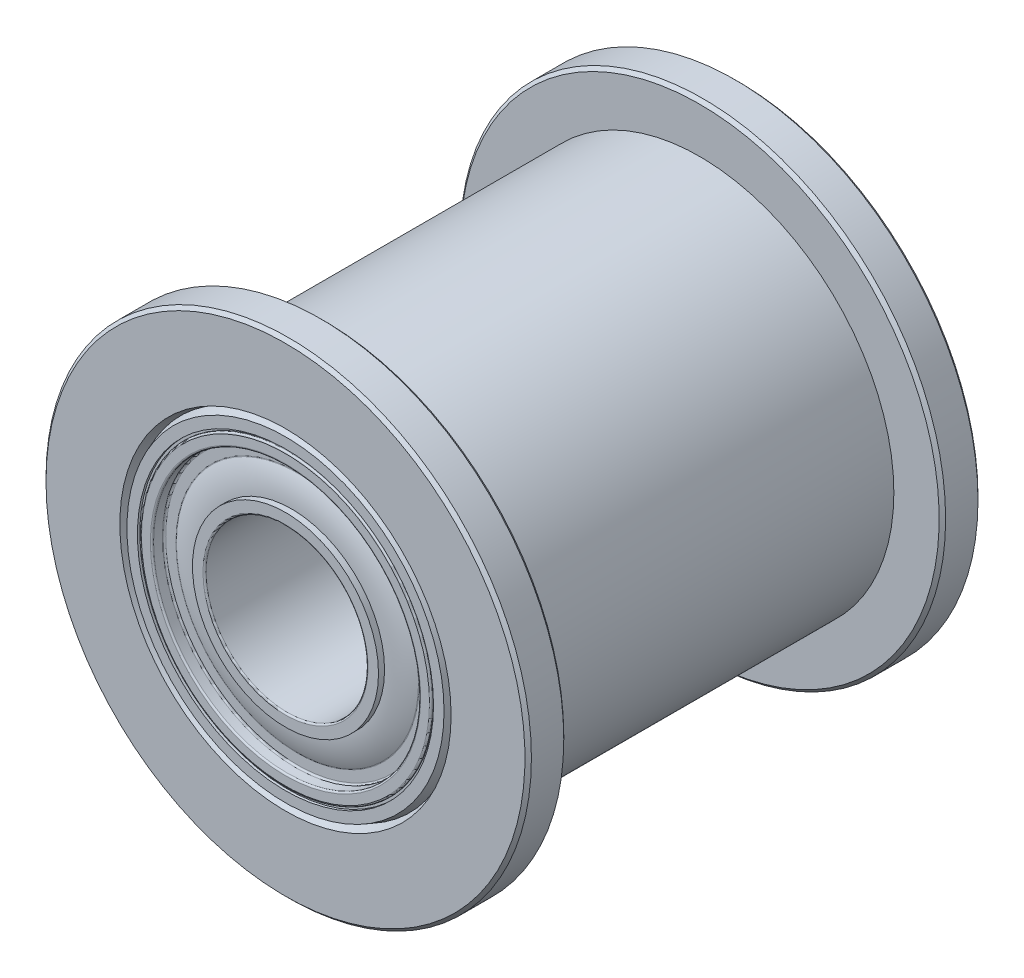
ISO-10303-21;
HEADER;
FILE_DESCRIPTION(('STEP AP214'),'2;1');
FILE_NAME('part.step','',(''),(''),'','','');
FILE_SCHEMA(('AUTOMOTIVE_DESIGN { 1 0 10303 214 1 1 1 1 }'));
ENDSEC;
DATA;
#1=APPLICATION_CONTEXT('core data for automotive mechanical design processes');
#2=APPLICATION_PROTOCOL_DEFINITION('international standard','automotive_design',2000,#1);
#3=PRODUCT_CONTEXT('',#1,'mechanical');
#4=PRODUCT('Part','Part','',(#3));
#5=PRODUCT_RELATED_PRODUCT_CATEGORY('part','',(#4));
#6=PRODUCT_DEFINITION_FORMATION('','',#4);
#7=PRODUCT_DEFINITION_CONTEXT('part definition',#1,'design');
#8=PRODUCT_DEFINITION('design','',#6,#7);
#9=PRODUCT_DEFINITION_SHAPE('','',#8);
#10=(LENGTH_UNIT() NAMED_UNIT(*) SI_UNIT(.MILLI.,.METRE.));
#11=(NAMED_UNIT(*) PLANE_ANGLE_UNIT() SI_UNIT($,.RADIAN.));
#12=(NAMED_UNIT(*) SI_UNIT($,.STERADIAN.) SOLID_ANGLE_UNIT());
#13=UNCERTAINTY_MEASURE_WITH_UNIT(LENGTH_MEASURE(1.E-05),#10,'distance_accuracy_value','');
#14=(GEOMETRIC_REPRESENTATION_CONTEXT(3) GLOBAL_UNCERTAINTY_ASSIGNED_CONTEXT((#13)) GLOBAL_UNIT_ASSIGNED_CONTEXT((#10,
#11,#12)) REPRESENTATION_CONTEXT('',''));
#15=CARTESIAN_POINT('',(0.,0.,0.));
#16=DIRECTION('',(0.,0.,1.));
#17=DIRECTION('',(1.,0.,0.));
#18=AXIS2_PLACEMENT_3D('',#15,#16,#17);
#19=CARTESIAN_POINT('',(0.,7.5,-5.8));
#20=DIRECTION('',(0.,0.,-1.));
#21=DIRECTION('',(-1.,0.,0.));
#22=AXIS2_PLACEMENT_3D('',#19,#20,#21);
#23=PLANE('',#22);
#24=CARTESIAN_POINT('',(0.,0.,-5.8));
#25=DIRECTION('',(0.,0.,-1.));
#26=DIRECTION('',(-1.,0.,0.));
#27=AXIS2_PLACEMENT_3D('',#24,#25,#26);
#28=CIRCLE('',#27,7.40000000000001);
#29=CARTESIAN_POINT('',(-7.40000000000001,0.,-5.8));
#30=VERTEX_POINT('',#29);
#31=EDGE_CURVE('E54',#30,#30,#28,.F.);
#32=ORIENTED_EDGE('',*,*,#31,.T.);
#33=EDGE_LOOP('',(#32));
#34=FACE_BOUND('',#33,.T.);
#35=CARTESIAN_POINT('',(0.,0.,-5.8));
#36=DIRECTION('',(0.,0.,1.));
#37=DIRECTION('',(1.,0.,0.));
#38=AXIS2_PLACEMENT_3D('',#35,#36,#37);
#39=CIRCLE('',#38,6.);
#40=CARTESIAN_POINT('',(6.,0.,-5.8));
#41=VERTEX_POINT('',#40);
#42=EDGE_CURVE('E85',#41,#41,#39,.T.);
#43=ORIENTED_EDGE('',*,*,#42,.F.);
#44=EDGE_LOOP('',(#43));
#45=FACE_BOUND('',#44,.T.);
#46=ADVANCED_FACE('F34',(#34,#45),#23,.F.);
#47=CARTESIAN_POINT('',(0.,0.,7.));
#48=DIRECTION('',(0.,0.,1.));
#49=DIRECTION('',(1.,0.,0.));
#50=AXIS2_PLACEMENT_3D('',#47,#48,#49);
#51=CYLINDRICAL_SURFACE('',#50,7.5);
#52=CARTESIAN_POINT('',(0.,0.,-6.9));
#53=DIRECTION('',(0.,0.,1.));
#54=DIRECTION('',(1.,0.,0.));
#55=AXIS2_PLACEMENT_3D('',#52,#53,#54);
#56=CIRCLE('',#55,7.5);
#57=CARTESIAN_POINT('',(7.5,0.,-6.9));
#58=VERTEX_POINT('',#57);
#59=EDGE_CURVE('E60',#58,#58,#56,.T.);
#60=ORIENTED_EDGE('',*,*,#59,.T.);
#61=EDGE_LOOP('',(#60));
#62=FACE_BOUND('',#61,.T.);
#63=CARTESIAN_POINT('',(0.,0.,-5.9));
#64=DIRECTION('',(0.,0.,-1.));
#65=DIRECTION('',(-1.,0.,0.));
#66=AXIS2_PLACEMENT_3D('',#63,#64,#65);
#67=CIRCLE('',#66,7.5);
#68=CARTESIAN_POINT('',(-7.5,0.,-5.9));
#69=VERTEX_POINT('',#68);
#70=EDGE_CURVE('E63',#69,#69,#67,.T.);
#71=ORIENTED_EDGE('',*,*,#70,.T.);
#72=EDGE_LOOP('',(#71));
#73=FACE_BOUND('',#72,.T.);
#74=ADVANCED_FACE('F200',(#62,#73),#51,.T.);
#75=CARTESIAN_POINT('',(0.,7.5,-7.));
#76=DIRECTION('',(0.,0.,1.));
#77=DIRECTION('',(1.,0.,0.));
#78=AXIS2_PLACEMENT_3D('',#75,#76,#77);
#79=PLANE('',#78);
#80=CARTESIAN_POINT('',(0.,0.,-7.));
#81=DIRECTION('',(0.,0.,1.));
#82=DIRECTION('',(1.,0.,0.));
#83=AXIS2_PLACEMENT_3D('',#80,#81,#82);
#84=CIRCLE('',#83,7.4);
#85=CARTESIAN_POINT('',(7.4,0.,-7.));
#86=VERTEX_POINT('',#85);
#87=EDGE_CURVE('E57',#86,#86,#84,.F.);
#88=ORIENTED_EDGE('',*,*,#87,.T.);
#89=EDGE_LOOP('',(#88));
#90=FACE_BOUND('',#89,.T.);
#91=CARTESIAN_POINT('',(0.,0.,-7.));
#92=DIRECTION('',(0.,0.,1.));
#93=DIRECTION('',(1.,0.,0.));
#94=AXIS2_PLACEMENT_3D('',#91,#92,#93);
#95=CIRCLE('',#94,5.11838214055972);
#96=CARTESIAN_POINT('',(5.11838214055972,0.,-7.));
#97=VERTEX_POINT('',#96);
#98=EDGE_CURVE('E66',#97,#97,#95,.T.);
#99=ORIENTED_EDGE('',*,*,#98,.T.);
#100=EDGE_LOOP('',(#99));
#101=FACE_BOUND('',#100,.T.);
#102=ADVANCED_FACE('F206',(#90,#101),#79,.F.);
#103=CARTESIAN_POINT('',(0.,0.,-6.7));
#104=DIRECTION('',(0.,0.,-1.));
#105=DIRECTION('',(-1.,0.,0.));
#106=AXIS2_PLACEMENT_3D('',#103,#104,#105);
#107=CONICAL_SURFACE('',#106,5.00919107027986,0.349065850398864);
#108=ORIENTED_EDGE('',*,*,#98,.F.);
#109=EDGE_LOOP('',(#108));
#110=FACE_BOUND('',#109,.T.);
#111=CARTESIAN_POINT('',(0.,0.,-6.7));
#112=DIRECTION('',(0.,0.,1.));
#113=DIRECTION('',(1.,0.,0.));
#114=AXIS2_PLACEMENT_3D('',#111,#112,#113);
#115=CIRCLE('',#114,5.00919107027986);
#116=CARTESIAN_POINT('',(5.00919107027986,0.,-6.7));
#117=VERTEX_POINT('',#116);
#118=EDGE_CURVE('E69',#117,#117,#115,.T.);
#119=ORIENTED_EDGE('',*,*,#118,.T.);
#120=EDGE_LOOP('',(#119));
#121=FACE_BOUND('',#120,.T.);
#122=ADVANCED_FACE('F282',(#110,#121),#107,.F.);
#123=CARTESIAN_POINT('',(0.,0.,-7.));
#124=DIRECTION('',(0.,0.,1.));
#125=DIRECTION('',(1.,0.,0.));
#126=AXIS2_PLACEMENT_3D('',#123,#124,#125);
#127=CONICAL_SURFACE('',#126,4.9,0.349065850398864);
#128=ORIENTED_EDGE('',*,*,#118,.F.);
#129=EDGE_LOOP('',(#128));
#130=FACE_BOUND('',#129,.T.);
#131=CARTESIAN_POINT('',(0.,0.,-7.));
#132=DIRECTION('',(0.,0.,1.));
#133=DIRECTION('',(1.,0.,0.));
#134=AXIS2_PLACEMENT_3D('',#131,#132,#133);
#135=CIRCLE('',#134,4.9);
#136=CARTESIAN_POINT('',(4.9,0.,-7.));
#137=VERTEX_POINT('',#136);
#138=EDGE_CURVE('E72',#137,#137,#135,.T.);
#139=ORIENTED_EDGE('',*,*,#138,.T.);
#140=EDGE_LOOP('',(#139));
#141=FACE_BOUND('',#140,.T.);
#142=ADVANCED_FACE('F278',(#130,#141),#127,.T.);
#143=CARTESIAN_POINT('',(0.,4.9,-7.));
#144=DIRECTION('',(0.,0.,1.));
#145=DIRECTION('',(1.,0.,0.));
#146=AXIS2_PLACEMENT_3D('',#143,#144,#145);
#147=PLANE('',#146);
#148=ORIENTED_EDGE('',*,*,#138,.F.);
#149=EDGE_LOOP('',(#148));
#150=FACE_BOUND('',#149,.T.);
#151=CARTESIAN_POINT('',(0.,0.,-7.));
#152=DIRECTION('',(0.,0.,1.));
#153=DIRECTION('',(1.,0.,0.));
#154=AXIS2_PLACEMENT_3D('',#151,#152,#153);
#155=CIRCLE('',#154,4.575);
#156=CARTESIAN_POINT('',(4.575,0.,-7.));
#157=VERTEX_POINT('',#156);
#158=EDGE_CURVE('E75',#157,#157,#155,.T.);
#159=ORIENTED_EDGE('',*,*,#158,.T.);
#160=EDGE_LOOP('',(#159));
#161=FACE_BOUND('',#160,.T.);
#162=ADVANCED_FACE('F274',(#150,#161),#147,.F.);
#163=CARTESIAN_POINT('',(0.,0.,7.));
#164=DIRECTION('',(0.,0.,1.));
#165=DIRECTION('',(1.,0.,0.));
#166=AXIS2_PLACEMENT_3D('',#163,#164,#165);
#167=CYLINDRICAL_SURFACE('',#166,4.575);
#168=ORIENTED_EDGE('',*,*,#158,.F.);
#169=EDGE_LOOP('',(#168));
#170=FACE_BOUND('',#169,.T.);
#171=CARTESIAN_POINT('',(0.,0.,-6.925));
#172=DIRECTION('',(0.,0.,1.));
#173=DIRECTION('',(1.,0.,0.));
#174=AXIS2_PLACEMENT_3D('',#171,#172,#173);
#175=CIRCLE('',#174,4.575);
#176=CARTESIAN_POINT('',(4.575,0.,-6.925));
#177=VERTEX_POINT('',#176);
#178=EDGE_CURVE('E78',#177,#177,#175,.T.);
#179=ORIENTED_EDGE('',*,*,#178,.T.);
#180=EDGE_LOOP('',(#179));
#181=FACE_BOUND('',#180,.T.);
#182=ADVANCED_FACE('F270',(#170,#181),#167,.F.);
#183=CARTESIAN_POINT('',(0.,4.5,-6.925));
#184=DIRECTION('',(0.,0.,1.));
#185=DIRECTION('',(1.,0.,0.));
#186=AXIS2_PLACEMENT_3D('',#183,#184,#185);
#187=PLANE('',#186);
#188=ORIENTED_EDGE('',*,*,#178,.F.);
#189=EDGE_LOOP('',(#188));
#190=FACE_BOUND('',#189,.T.);
#191=CARTESIAN_POINT('',(0.,0.,-6.925));
#192=DIRECTION('',(0.,0.,1.));
#193=DIRECTION('',(1.,0.,0.));
#194=AXIS2_PLACEMENT_3D('',#191,#192,#193);
#195=CIRCLE('',#194,4.5);
#196=CARTESIAN_POINT('',(4.5,0.,-6.925));
#197=VERTEX_POINT('',#196);
#198=EDGE_CURVE('E82',#197,#197,#195,.T.);
#199=ORIENTED_EDGE('',*,*,#198,.T.);
#200=EDGE_LOOP('',(#199));
#201=FACE_BOUND('',#200,.T.);
#202=ADVANCED_FACE('F266',(#190,#201),#187,.F.);
#203=CARTESIAN_POINT('',(0.,4.5,6.925));
#204=DIRECTION('',(0.,0.,-1.));
#205=DIRECTION('',(-1.,0.,0.));
#206=AXIS2_PLACEMENT_3D('',#203,#204,#205);
#207=PLANE('',#206);
#208=CARTESIAN_POINT('',(0.,0.,6.925));
#209=DIRECTION('',(0.,0.,1.));
#210=DIRECTION('',(1.,0.,0.));
#211=AXIS2_PLACEMENT_3D('',#208,#209,#210);
#212=CIRCLE('',#211,4.5);
#213=CARTESIAN_POINT('',(4.5,0.,6.925));
#214=VERTEX_POINT('',#213);
#215=EDGE_CURVE('E81',#214,#214,#212,.T.);
#216=ORIENTED_EDGE('',*,*,#215,.F.);
#217=EDGE_LOOP('',(#216));
#218=FACE_BOUND('',#217,.T.);
#219=CARTESIAN_POINT('',(0.,0.,6.925));
#220=DIRECTION('',(0.,0.,1.));
#221=DIRECTION('',(1.,0.,0.));
#222=AXIS2_PLACEMENT_3D('',#219,#220,#221);
#223=CIRCLE('',#222,4.575);
#224=CARTESIAN_POINT('',(4.575,0.,6.925));
#225=VERTEX_POINT('',#224);
#226=EDGE_CURVE('E89',#225,#225,#223,.T.);
#227=ORIENTED_EDGE('',*,*,#226,.T.);
#228=EDGE_LOOP('',(#227));
#229=FACE_BOUND('',#228,.T.);
#230=ADVANCED_FACE('F262',(#218,#229),#207,.F.);
#231=CARTESIAN_POINT('',(0.,0.,7.));
#232=DIRECTION('',(0.,0.,1.));
#233=DIRECTION('',(1.,0.,0.));
#234=AXIS2_PLACEMENT_3D('',#231,#232,#233);
#235=CYLINDRICAL_SURFACE('',#234,4.575);
#236=ORIENTED_EDGE('',*,*,#226,.F.);
#237=EDGE_LOOP('',(#236));
#238=FACE_BOUND('',#237,.T.);
#239=CARTESIAN_POINT('',(0.,0.,7.));
#240=DIRECTION('',(0.,0.,1.));
#241=DIRECTION('',(1.,0.,0.));
#242=AXIS2_PLACEMENT_3D('',#239,#240,#241);
#243=CIRCLE('',#242,4.575);
#244=CARTESIAN_POINT('',(4.575,0.,7.));
#245=VERTEX_POINT('',#244);
#246=EDGE_CURVE('E92',#245,#245,#243,.T.);
#247=ORIENTED_EDGE('',*,*,#246,.T.);
#248=EDGE_LOOP('',(#247));
#249=FACE_BOUND('',#248,.T.);
#250=ADVANCED_FACE('F258',(#238,#249),#235,.F.);
#251=CARTESIAN_POINT('',(0.,4.9,7.));
#252=DIRECTION('',(0.,0.,-1.));
#253=DIRECTION('',(-1.,0.,0.));
#254=AXIS2_PLACEMENT_3D('',#251,#252,#253);
#255=PLANE('',#254);
#256=ORIENTED_EDGE('',*,*,#246,.F.);
#257=EDGE_LOOP('',(#256));
#258=FACE_BOUND('',#257,.T.);
#259=CARTESIAN_POINT('',(0.,0.,7.));
#260=DIRECTION('',(0.,0.,1.));
#261=DIRECTION('',(1.,0.,0.));
#262=AXIS2_PLACEMENT_3D('',#259,#260,#261);
#263=CIRCLE('',#262,4.9);
#264=CARTESIAN_POINT('',(4.9,0.,7.));
#265=VERTEX_POINT('',#264);
#266=EDGE_CURVE('E95',#265,#265,#263,.T.);
#267=ORIENTED_EDGE('',*,*,#266,.T.);
#268=EDGE_LOOP('',(#267));
#269=FACE_BOUND('',#268,.T.);
#270=ADVANCED_FACE('F254',(#258,#269),#255,.F.);
#271=CARTESIAN_POINT('',(0.,0.,6.7));
#272=DIRECTION('',(0.,0.,-1.));
#273=DIRECTION('',(-1.,0.,0.));
#274=AXIS2_PLACEMENT_3D('',#271,#272,#273);
#275=CONICAL_SURFACE('',#274,5.00919107027986,0.349065850398864);
#276=ORIENTED_EDGE('',*,*,#266,.F.);
#277=EDGE_LOOP('',(#276));
#278=FACE_BOUND('',#277,.T.);
#279=CARTESIAN_POINT('',(0.,0.,6.7));
#280=DIRECTION('',(0.,0.,1.));
#281=DIRECTION('',(1.,0.,0.));
#282=AXIS2_PLACEMENT_3D('',#279,#280,#281);
#283=CIRCLE('',#282,5.00919107027986);
#284=CARTESIAN_POINT('',(5.00919107027986,0.,6.7));
#285=VERTEX_POINT('',#284);
#286=EDGE_CURVE('E98',#285,#285,#283,.T.);
#287=ORIENTED_EDGE('',*,*,#286,.T.);
#288=EDGE_LOOP('',(#287));
#289=FACE_BOUND('',#288,.T.);
#290=ADVANCED_FACE('F250',(#278,#289),#275,.T.);
#291=CARTESIAN_POINT('',(0.,0.,7.));
#292=DIRECTION('',(0.,0.,1.));
#293=DIRECTION('',(1.,0.,0.));
#294=AXIS2_PLACEMENT_3D('',#291,#292,#293);
#295=CONICAL_SURFACE('',#294,5.11838214055972,0.349065850398864);
#296=ORIENTED_EDGE('',*,*,#286,.F.);
#297=EDGE_LOOP('',(#296));
#298=FACE_BOUND('',#297,.T.);
#299=CARTESIAN_POINT('',(0.,0.,7.));
#300=DIRECTION('',(0.,0.,1.));
#301=DIRECTION('',(1.,0.,0.));
#302=AXIS2_PLACEMENT_3D('',#299,#300,#301);
#303=CIRCLE('',#302,5.11838214055972);
#304=CARTESIAN_POINT('',(5.11838214055972,0.,7.));
#305=VERTEX_POINT('',#304);
#306=EDGE_CURVE('E101',#305,#305,#303,.T.);
#307=ORIENTED_EDGE('',*,*,#306,.T.);
#308=EDGE_LOOP('',(#307));
#309=FACE_BOUND('',#308,.T.);
#310=ADVANCED_FACE('F244',(#298,#309),#295,.F.);
#311=CARTESIAN_POINT('',(0.,7.5,7.));
#312=DIRECTION('',(0.,0.,-1.));
#313=DIRECTION('',(-1.,0.,0.));
#314=AXIS2_PLACEMENT_3D('',#311,#312,#313);
#315=PLANE('',#314);
#316=CARTESIAN_POINT('',(0.,0.,7.));
#317=DIRECTION('',(0.,0.,-1.));
#318=DIRECTION('',(-1.,0.,0.));
#319=AXIS2_PLACEMENT_3D('',#316,#317,#318);
#320=CIRCLE('',#319,7.4);
#321=CARTESIAN_POINT('',(-7.4,0.,7.));
#322=VERTEX_POINT('',#321);
#323=EDGE_CURVE('E10',#322,#322,#320,.F.);
#324=ORIENTED_EDGE('',*,*,#323,.T.);
#325=EDGE_LOOP('',(#324));
#326=FACE_BOUND('',#325,.T.);
#327=ORIENTED_EDGE('',*,*,#306,.F.);
#328=EDGE_LOOP('',(#327));
#329=FACE_BOUND('',#328,.T.);
#330=ADVANCED_FACE('F235',(#326,#329),#315,.F.);
#331=CARTESIAN_POINT('',(0.,0.,7.));
#332=DIRECTION('',(0.,0.,1.));
#333=DIRECTION('',(1.,0.,0.));
#334=AXIS2_PLACEMENT_3D('',#331,#332,#333);
#335=CYLINDRICAL_SURFACE('',#334,7.5);
#336=CARTESIAN_POINT('',(0.,0.,5.9));
#337=DIRECTION('',(0.,0.,1.));
#338=DIRECTION('',(1.,0.,0.));
#339=AXIS2_PLACEMENT_3D('',#336,#337,#338);
#340=CIRCLE('',#339,7.5);
#341=CARTESIAN_POINT('',(7.5,0.,5.9));
#342=VERTEX_POINT('',#341);
#343=EDGE_CURVE('E45',#342,#342,#340,.T.);
#344=ORIENTED_EDGE('',*,*,#343,.T.);
#345=EDGE_LOOP('',(#344));
#346=FACE_BOUND('',#345,.T.);
#347=CARTESIAN_POINT('',(0.,0.,6.9));
#348=DIRECTION('',(0.,0.,-1.));
#349=DIRECTION('',(-1.,0.,0.));
#350=AXIS2_PLACEMENT_3D('',#347,#348,#349);
#351=CIRCLE('',#350,7.5);
#352=CARTESIAN_POINT('',(-7.5,0.,6.9));
#353=VERTEX_POINT('',#352);
#354=EDGE_CURVE('E49',#353,#353,#351,.T.);
#355=ORIENTED_EDGE('',*,*,#354,.T.);
#356=EDGE_LOOP('',(#355));
#357=FACE_BOUND('',#356,.T.);
#358=ADVANCED_FACE('F231',(#346,#357),#335,.T.);
#359=CARTESIAN_POINT('',(0.,7.5,5.8));
#360=DIRECTION('',(0.,0.,1.));
#361=DIRECTION('',(1.,0.,0.));
#362=AXIS2_PLACEMENT_3D('',#359,#360,#361);
#363=PLANE('',#362);
#364=CARTESIAN_POINT('',(0.,0.,5.8));
#365=DIRECTION('',(0.,0.,1.));
#366=DIRECTION('',(1.,0.,0.));
#367=AXIS2_PLACEMENT_3D('',#364,#365,#366);
#368=CIRCLE('',#367,7.4);
#369=CARTESIAN_POINT('',(7.4,0.,5.8));
#370=VERTEX_POINT('',#369);
#371=EDGE_CURVE('E41',#370,#370,#368,.F.);
#372=ORIENTED_EDGE('',*,*,#371,.T.);
#373=EDGE_LOOP('',(#372));
#374=FACE_BOUND('',#373,.T.);
#375=CARTESIAN_POINT('',(0.,0.,5.8));
#376=DIRECTION('',(0.,0.,1.));
#377=DIRECTION('',(1.,0.,0.));
#378=AXIS2_PLACEMENT_3D('',#375,#376,#377);
#379=CIRCLE('',#378,6.);
#380=CARTESIAN_POINT('',(6.,0.,5.8));
#381=VERTEX_POINT('',#380);
#382=EDGE_CURVE('E104',#381,#381,#379,.T.);
#383=ORIENTED_EDGE('',*,*,#382,.T.);
#384=EDGE_LOOP('',(#383));
#385=FACE_BOUND('',#384,.T.);
#386=ADVANCED_FACE('F234',(#374,#385),#363,.F.);
#387=CARTESIAN_POINT('',(0.,0.,7.));
#388=DIRECTION('',(0.,0.,1.));
#389=DIRECTION('',(1.,0.,0.));
#390=AXIS2_PLACEMENT_3D('',#387,#388,#389);
#391=CYLINDRICAL_SURFACE('',#390,6.);
#392=ORIENTED_EDGE('',*,*,#382,.F.);
#393=EDGE_LOOP('',(#392));
#394=FACE_BOUND('',#393,.T.);
#395=ORIENTED_EDGE('',*,*,#42,.T.);
#396=EDGE_LOOP('',(#395));
#397=FACE_BOUND('',#396,.T.);
#398=ADVANCED_FACE('F216',(#394,#397),#391,.T.);
#399=CARTESIAN_POINT('',(0.,0.,-6.9));
#400=DIRECTION('',(0.,0.,1.));
#401=DIRECTION('',(1.,0.,0.));
#402=AXIS2_PLACEMENT_3D('',#399,#400,#401);
#403=CONICAL_SURFACE('',#402,7.5,0.78539816339744);
#404=ORIENTED_EDGE('',*,*,#87,.F.);
#405=EDGE_LOOP('',(#404));
#406=FACE_BOUND('',#405,.T.);
#407=ORIENTED_EDGE('',*,*,#59,.F.);
#408=EDGE_LOOP('',(#407));
#409=FACE_BOUND('',#408,.T.);
#410=ADVANCED_FACE('F212',(#406,#409),#403,.T.);
#411=CARTESIAN_POINT('',(0.,0.,-5.8));
#412=DIRECTION('',(0.,0.,-1.));
#413=DIRECTION('',(-1.,0.,0.));
#414=AXIS2_PLACEMENT_3D('',#411,#412,#413);
#415=CONICAL_SURFACE('',#414,7.40000000000001,0.785398163397457);
#416=ORIENTED_EDGE('',*,*,#70,.F.);
#417=EDGE_LOOP('',(#416));
#418=FACE_BOUND('',#417,.T.);
#419=ORIENTED_EDGE('',*,*,#31,.F.);
#420=EDGE_LOOP('',(#419));
#421=FACE_BOUND('',#420,.T.);
#422=ADVANCED_FACE('F215',(#418,#421),#415,.T.);
#423=CARTESIAN_POINT('',(0.,0.,5.9));
#424=DIRECTION('',(0.,0.,1.));
#425=DIRECTION('',(1.,0.,0.));
#426=AXIS2_PLACEMENT_3D('',#423,#424,#425);
#427=CONICAL_SURFACE('',#426,7.5,0.785398163397444);
#428=ORIENTED_EDGE('',*,*,#371,.F.);
#429=EDGE_LOOP('',(#428));
#430=FACE_BOUND('',#429,.T.);
#431=ORIENTED_EDGE('',*,*,#343,.F.);
#432=EDGE_LOOP('',(#431));
#433=FACE_BOUND('',#432,.T.);
#434=ADVANCED_FACE('F219',(#430,#433),#427,.T.);
#435=CARTESIAN_POINT('',(0.,0.,7.));
#436=DIRECTION('',(0.,0.,-1.));
#437=DIRECTION('',(-1.,0.,0.));
#438=AXIS2_PLACEMENT_3D('',#435,#436,#437);
#439=CONICAL_SURFACE('',#438,7.4,0.785398163397448);
#440=ORIENTED_EDGE('',*,*,#354,.F.);
#441=EDGE_LOOP('',(#440));
#442=FACE_BOUND('',#441,.T.);
#443=ORIENTED_EDGE('',*,*,#323,.F.);
#444=EDGE_LOOP('',(#443));
#445=FACE_BOUND('',#444,.T.);
#446=ADVANCED_FACE('F36',(#442,#445),#439,.T.);
#447=CARTESIAN_POINT('',(0.,0.,7.));
#448=DIRECTION('',(0.,0.,1.));
#449=DIRECTION('',(1.,0.,0.));
#450=AXIS2_PLACEMENT_3D('',#447,#448,#449);
#451=CYLINDRICAL_SURFACE('',#450,4.5);
#452=CARTESIAN_POINT('',(0.,0.,6.95));
#453=DIRECTION('',(0.,0.,-1.));
#454=DIRECTION('',(-1.,0.,0.));
#455=AXIS2_PLACEMENT_3D('',#452,#453,#454);
#456=CIRCLE('',#455,4.5);
#457=CARTESIAN_POINT('',(-4.5,0.,6.95));
#458=VERTEX_POINT('',#457);
#459=EDGE_CURVE('E150',#458,#458,#456,.T.);
#460=ORIENTED_EDGE('',*,*,#459,.T.);
#461=EDGE_LOOP('',(#460));
#462=FACE_BOUND('',#461,.T.);
#463=ORIENTED_EDGE('',*,*,#215,.T.);
#464=EDGE_LOOP('',(#463));
#465=FACE_BOUND('',#464,.T.);
#466=ADVANCED_FACE('F226',(#462,#465),#451,.T.);
#467=CARTESIAN_POINT('',(0.,2.5,-7.));
#468=DIRECTION('',(0.,0.,1.));
#469=DIRECTION('',(1.,0.,0.));
#470=AXIS2_PLACEMENT_3D('',#467,#468,#469);
#471=PLANE('',#470);
#472=CARTESIAN_POINT('',(0.,0.,-7.));
#473=DIRECTION('',(0.,0.,1.));
#474=DIRECTION('',(1.,0.,0.));
#475=AXIS2_PLACEMENT_3D('',#472,#473,#474);
#476=CIRCLE('',#475,2.55);
#477=CARTESIAN_POINT('',(2.55,0.,-7.));
#478=VERTEX_POINT('',#477);
#479=EDGE_CURVE('E162',#478,#478,#476,.T.);
#480=ORIENTED_EDGE('',*,*,#479,.T.);
#481=EDGE_LOOP('',(#480));
#482=FACE_BOUND('',#481,.T.);
#483=CARTESIAN_POINT('',(0.,0.,-7.));
#484=DIRECTION('',(0.,0.,1.));
#485=DIRECTION('',(1.,0.,0.));
#486=AXIS2_PLACEMENT_3D('',#483,#484,#485);
#487=CIRCLE('',#486,2.825);
#488=CARTESIAN_POINT('',(2.825,0.,-7.));
#489=VERTEX_POINT('',#488);
#490=EDGE_CURVE('E165',#489,#489,#487,.F.);
#491=ORIENTED_EDGE('',*,*,#490,.T.);
#492=EDGE_LOOP('',(#491));
#493=FACE_BOUND('',#492,.T.);
#494=ADVANCED_FACE('F470',(#482,#493),#471,.F.);
#495=CARTESIAN_POINT('',(0.,0.,7.));
#496=DIRECTION('',(0.,0.,1.));
#497=DIRECTION('',(1.,0.,0.));
#498=AXIS2_PLACEMENT_3D('',#495,#496,#497);
#499=CYLINDRICAL_SURFACE('',#498,2.5);
#500=CARTESIAN_POINT('',(0.,0.,-6.95));
#501=DIRECTION('',(0.,0.,1.));
#502=DIRECTION('',(1.,0.,0.));
#503=AXIS2_PLACEMENT_3D('',#500,#501,#502);
#504=CIRCLE('',#503,2.5);
#505=CARTESIAN_POINT('',(2.5,0.,-6.95));
#506=VERTEX_POINT('',#505);
#507=EDGE_CURVE('E156',#506,#506,#504,.F.);
#508=ORIENTED_EDGE('',*,*,#507,.T.);
#509=EDGE_LOOP('',(#508));
#510=FACE_BOUND('',#509,.T.);
#511=CARTESIAN_POINT('',(0.,0.,6.95));
#512=DIRECTION('',(0.,0.,-1.));
#513=DIRECTION('',(-1.,0.,0.));
#514=AXIS2_PLACEMENT_3D('',#511,#512,#513);
#515=CIRCLE('',#514,2.5);
#516=CARTESIAN_POINT('',(-2.5,0.,6.95));
#517=VERTEX_POINT('',#516);
#518=EDGE_CURVE('E159',#517,#517,#515,.F.);
#519=ORIENTED_EDGE('',*,*,#518,.T.);
#520=EDGE_LOOP('',(#519));
#521=FACE_BOUND('',#520,.T.);
#522=ADVANCED_FACE('F308',(#510,#521),#499,.F.);
#523=ORIENTED_EDGE('',*,*,#198,.F.);
#524=EDGE_LOOP('',(#523));
#525=FACE_BOUND('',#524,.T.);
#526=CARTESIAN_POINT('',(0.,0.,-6.95));
#527=DIRECTION('',(0.,0.,1.));
#528=DIRECTION('',(1.,0.,0.));
#529=AXIS2_PLACEMENT_3D('',#526,#527,#528);
#530=CIRCLE('',#529,4.5);
#531=CARTESIAN_POINT('',(4.5,0.,-6.95));
#532=VERTEX_POINT('',#531);
#533=EDGE_CURVE('E147',#532,#532,#530,.T.);
#534=ORIENTED_EDGE('',*,*,#533,.T.);
#535=EDGE_LOOP('',(#534));
#536=FACE_BOUND('',#535,.T.);
#537=ADVANCED_FACE('F304',(#525,#536),#451,.T.);
#538=CARTESIAN_POINT('',(0.,4.5,-7.));
#539=DIRECTION('',(0.,0.,1.));
#540=DIRECTION('',(1.,0.,0.));
#541=AXIS2_PLACEMENT_3D('',#538,#539,#540);
#542=PLANE('',#541);
#543=CARTESIAN_POINT('',(0.,0.,-7.));
#544=DIRECTION('',(0.,0.,1.));
#545=DIRECTION('',(1.,0.,0.));
#546=AXIS2_PLACEMENT_3D('',#543,#544,#545);
#547=CIRCLE('',#546,4.45);
#548=CARTESIAN_POINT('',(4.45,0.,-7.));
#549=VERTEX_POINT('',#548);
#550=EDGE_CURVE('E141',#549,#549,#547,.F.);
#551=ORIENTED_EDGE('',*,*,#550,.T.);
#552=EDGE_LOOP('',(#551));
#553=FACE_BOUND('',#552,.T.);
#554=CARTESIAN_POINT('',(0.,0.,-7.));
#555=DIRECTION('',(0.,0.,1.));
#556=DIRECTION('',(1.,0.,0.));
#557=AXIS2_PLACEMENT_3D('',#554,#555,#556);
#558=CIRCLE('',#557,4.175);
#559=CARTESIAN_POINT('',(4.175,0.,-7.));
#560=VERTEX_POINT('',#559);
#561=EDGE_CURVE('E144',#560,#560,#558,.T.);
#562=ORIENTED_EDGE('',*,*,#561,.T.);
#563=EDGE_LOOP('',(#562));
#564=FACE_BOUND('',#563,.T.);
#565=ADVANCED_FACE('F307',(#553,#564),#542,.F.);
#566=CARTESIAN_POINT('',(0.,0.,7.));
#567=DIRECTION('',(0.,0.,1.));
#568=DIRECTION('',(1.,0.,0.));
#569=AXIS2_PLACEMENT_3D('',#566,#567,#568);
#570=CYLINDRICAL_SURFACE('',#569,4.125);
#571=CARTESIAN_POINT('',(0.,0.,-6.95));
#572=DIRECTION('',(0.,0.,1.));
#573=DIRECTION('',(1.,0.,0.));
#574=AXIS2_PLACEMENT_3D('',#571,#572,#573);
#575=CIRCLE('',#574,4.125);
#576=CARTESIAN_POINT('',(4.125,0.,-6.95));
#577=VERTEX_POINT('',#576);
#578=EDGE_CURVE('E132',#577,#577,#575,.F.);
#579=ORIENTED_EDGE('',*,*,#578,.T.);
#580=EDGE_LOOP('',(#579));
#581=FACE_BOUND('',#580,.T.);
#582=CARTESIAN_POINT('',(0.,0.,-6.625));
#583=DIRECTION('',(0.,0.,1.));
#584=DIRECTION('',(1.,0.,0.));
#585=AXIS2_PLACEMENT_3D('',#582,#583,#584);
#586=CIRCLE('',#585,4.125);
#587=CARTESIAN_POINT('',(4.125,0.,-6.625));
#588=VERTEX_POINT('',#587);
#589=EDGE_CURVE('E168',#588,#588,#586,.T.);
#590=ORIENTED_EDGE('',*,*,#589,.T.);
#591=EDGE_LOOP('',(#590));
#592=FACE_BOUND('',#591,.T.);
#593=ADVANCED_FACE('F506',(#581,#592),#570,.F.);
#594=CARTESIAN_POINT('',(0.,3.75,-6.625));
#595=DIRECTION('',(0.,0.,1.));
#596=DIRECTION('',(1.,0.,0.));
#597=AXIS2_PLACEMENT_3D('',#594,#595,#596);
#598=PLANE('',#597);
#599=CARTESIAN_POINT('',(0.,0.,-6.625));
#600=DIRECTION('',(0.,0.,1.));
#601=DIRECTION('',(1.,0.,0.));
#602=AXIS2_PLACEMENT_3D('',#599,#600,#601);
#603=CIRCLE('',#602,3.76064947919592);
#604=CARTESIAN_POINT('',(3.76064947919592,0.,-6.625));
#605=VERTEX_POINT('',#604);
#606=EDGE_CURVE('E138',#605,#605,#603,.T.);
#607=ORIENTED_EDGE('',*,*,#606,.T.);
#608=EDGE_LOOP('',(#607));
#609=FACE_BOUND('',#608,.T.);
#610=ORIENTED_EDGE('',*,*,#589,.F.);
#611=EDGE_LOOP('',(#610));
#612=FACE_BOUND('',#611,.T.);
#613=ADVANCED_FACE('F516',(#609,#612),#598,.F.);
#614=CARTESIAN_POINT('',(0.,0.,-4.67708333333337));
#615=DIRECTION('',(0.,0.,1.));
#616=DIRECTION('',(1.,0.,0.));
#617=AXIS2_PLACEMENT_3D('',#614,#615,#616);
#618=TOROIDAL_SURFACE('',#617,2.875,2.13541666666663);
#619=CARTESIAN_POINT('',(0.,0.,-6.62928979980934));
#620=DIRECTION('',(0.,0.,1.));
#621=DIRECTION('',(1.,0.,0.));
#622=AXIS2_PLACEMENT_3D('',#619,#620,#621);
#623=CIRCLE('',#622,3.74038676470526);
#624=CARTESIAN_POINT('',(3.74038676470526,0.,-6.62928979980934));
#625=VERTEX_POINT('',#624);
#626=EDGE_CURVE('E135',#625,#625,#623,.F.);
#627=ORIENTED_EDGE('',*,*,#626,.T.);
#628=EDGE_LOOP('',(#627));
#629=FACE_BOUND('',#628,.T.);
#630=CARTESIAN_POINT('',(0.,0.,-6.8125));
#631=DIRECTION('',(0.,0.,1.));
#632=DIRECTION('',(1.,0.,0.));
#633=AXIS2_PLACEMENT_3D('',#630,#631,#632);
#634=CIRCLE('',#633,2.875);
#635=CARTESIAN_POINT('',(2.875,0.,-6.8125));
#636=VERTEX_POINT('',#635);
#637=EDGE_CURVE('E171',#636,#636,#634,.T.);
#638=ORIENTED_EDGE('',*,*,#637,.T.);
#639=EDGE_LOOP('',(#638));
#640=FACE_BOUND('',#639,.T.);
#641=ADVANCED_FACE('F526',(#629,#640),#618,.T.);
#642=CARTESIAN_POINT('',(0.,0.,7.));
#643=DIRECTION('',(0.,0.,1.));
#644=DIRECTION('',(1.,0.,0.));
#645=AXIS2_PLACEMENT_3D('',#642,#643,#644);
#646=CYLINDRICAL_SURFACE('',#645,2.875);
#647=CARTESIAN_POINT('',(0.,0.,-6.95));
#648=DIRECTION('',(0.,0.,1.));
#649=DIRECTION('',(1.,0.,0.));
#650=AXIS2_PLACEMENT_3D('',#647,#648,#649);
#651=CIRCLE('',#650,2.875);
#652=CARTESIAN_POINT('',(2.875,0.,-6.95));
#653=VERTEX_POINT('',#652);
#654=EDGE_CURVE('E153',#653,#653,#651,.T.);
#655=ORIENTED_EDGE('',*,*,#654,.T.);
#656=EDGE_LOOP('',(#655));
#657=FACE_BOUND('',#656,.T.);
#658=ORIENTED_EDGE('',*,*,#637,.F.);
#659=EDGE_LOOP('',(#658));
#660=FACE_BOUND('',#659,.T.);
#661=ADVANCED_FACE('F536',(#657,#660),#646,.T.);
#662=CARTESIAN_POINT('',(0.,2.5,7.));
#663=DIRECTION('',(0.,0.,-1.));
#664=DIRECTION('',(1.,0.,0.));
#665=AXIS2_PLACEMENT_3D('',#662,#663,#664);
#666=PLANE('',#665);
#667=CARTESIAN_POINT('',(0.,0.,7.));
#668=DIRECTION('',(0.,0.,-1.));
#669=DIRECTION('',(-1.,0.,0.));
#670=AXIS2_PLACEMENT_3D('',#667,#668,#669);
#671=CIRCLE('',#670,2.55);
#672=CARTESIAN_POINT('',(-2.55,0.,7.));
#673=VERTEX_POINT('',#672);
#674=EDGE_CURVE('E86',#673,#673,#671,.T.);
#675=ORIENTED_EDGE('',*,*,#674,.T.);
#676=EDGE_LOOP('',(#675));
#677=FACE_BOUND('',#676,.T.);
#678=CARTESIAN_POINT('',(0.,0.,7.));
#679=DIRECTION('',(0.,0.,1.));
#680=DIRECTION('',(1.,0.,0.));
#681=AXIS2_PLACEMENT_3D('',#678,#679,#680);
#682=CIRCLE('',#681,2.875);
#683=CARTESIAN_POINT('',(2.875,0.,7.));
#684=VERTEX_POINT('',#683);
#685=EDGE_CURVE('E177',#684,#684,#682,.T.);
#686=ORIENTED_EDGE('',*,*,#685,.T.);
#687=EDGE_LOOP('',(#686));
#688=FACE_BOUND('',#687,.T.);
#689=ADVANCED_FACE('F181',(#677,#688),#666,.F.);
#690=CARTESIAN_POINT('',(0.,4.5,7.));
#691=DIRECTION('',(0.,0.,-1.));
#692=DIRECTION('',(1.,0.,0.));
#693=AXIS2_PLACEMENT_3D('',#690,#691,#692);
#694=PLANE('',#693);
#695=CARTESIAN_POINT('',(0.,0.,7.));
#696=DIRECTION('',(0.,0.,-1.));
#697=DIRECTION('',(-1.,0.,0.));
#698=AXIS2_PLACEMENT_3D('',#695,#696,#697);
#699=CIRCLE('',#698,4.45);
#700=CARTESIAN_POINT('',(-4.45,0.,7.));
#701=VERTEX_POINT('',#700);
#702=EDGE_CURVE('E111',#701,#701,#699,.F.);
#703=ORIENTED_EDGE('',*,*,#702,.T.);
#704=EDGE_LOOP('',(#703));
#705=FACE_BOUND('',#704,.T.);
#706=CARTESIAN_POINT('',(0.,0.,7.));
#707=DIRECTION('',(0.,0.,-1.));
#708=DIRECTION('',(-1.,0.,0.));
#709=AXIS2_PLACEMENT_3D('',#706,#707,#708);
#710=CIRCLE('',#709,4.175);
#711=CARTESIAN_POINT('',(-4.175,0.,7.));
#712=VERTEX_POINT('',#711);
#713=EDGE_CURVE('E114',#712,#712,#710,.T.);
#714=ORIENTED_EDGE('',*,*,#713,.T.);
#715=EDGE_LOOP('',(#714));
#716=FACE_BOUND('',#715,.T.);
#717=ADVANCED_FACE('F555',(#705,#716),#694,.F.);
#718=CARTESIAN_POINT('',(0.,0.,-7.));
#719=DIRECTION('',(0.,0.,-1.));
#720=DIRECTION('',(1.,0.,0.));
#721=AXIS2_PLACEMENT_3D('',#718,#719,#720);
#722=CYLINDRICAL_SURFACE('',#721,4.125);
#723=CARTESIAN_POINT('',(0.,0.,6.675));
#724=DIRECTION('',(0.,0.,-1.));
#725=DIRECTION('',(-1.,0.,0.));
#726=AXIS2_PLACEMENT_3D('',#723,#724,#725);
#727=CIRCLE('',#726,4.125);
#728=CARTESIAN_POINT('',(-4.125,0.,6.675));
#729=VERTEX_POINT('',#728);
#730=EDGE_CURVE('E117',#729,#729,#727,.T.);
#731=ORIENTED_EDGE('',*,*,#730,.T.);
#732=EDGE_LOOP('',(#731));
#733=FACE_BOUND('',#732,.T.);
#734=CARTESIAN_POINT('',(0.,0.,6.95));
#735=DIRECTION('',(0.,0.,-1.));
#736=DIRECTION('',(-1.,0.,0.));
#737=AXIS2_PLACEMENT_3D('',#734,#735,#736);
#738=CIRCLE('',#737,4.125);
#739=CARTESIAN_POINT('',(-4.125,0.,6.95));
#740=VERTEX_POINT('',#739);
#741=EDGE_CURVE('E120',#740,#740,#738,.F.);
#742=ORIENTED_EDGE('',*,*,#741,.T.);
#743=EDGE_LOOP('',(#742));
#744=FACE_BOUND('',#743,.T.);
#745=ADVANCED_FACE('F565',(#733,#744),#722,.F.);
#746=CARTESIAN_POINT('',(0.,3.75,6.625));
#747=DIRECTION('',(0.,0.,-1.));
#748=DIRECTION('',(1.,0.,0.));
#749=AXIS2_PLACEMENT_3D('',#746,#747,#748);
#750=PLANE('',#749);
#751=CARTESIAN_POINT('',(0.,0.,6.625));
#752=DIRECTION('',(0.,0.,-1.));
#753=DIRECTION('',(-1.,0.,0.));
#754=AXIS2_PLACEMENT_3D('',#751,#752,#753);
#755=CIRCLE('',#754,3.76064947919592);
#756=CARTESIAN_POINT('',(-3.76064947919592,0.,6.625));
#757=VERTEX_POINT('',#756);
#758=EDGE_CURVE('E123',#757,#757,#755,.T.);
#759=ORIENTED_EDGE('',*,*,#758,.T.);
#760=EDGE_LOOP('',(#759));
#761=FACE_BOUND('',#760,.T.);
#762=CARTESIAN_POINT('',(0.,0.,6.625));
#763=DIRECTION('',(0.,0.,-1.));
#764=DIRECTION('',(-1.,0.,0.));
#765=AXIS2_PLACEMENT_3D('',#762,#763,#764);
#766=CIRCLE('',#765,4.075);
#767=CARTESIAN_POINT('',(-4.075,0.,6.625));
#768=VERTEX_POINT('',#767);
#769=EDGE_CURVE('E126',#768,#768,#766,.F.);
#770=ORIENTED_EDGE('',*,*,#769,.T.);
#771=EDGE_LOOP('',(#770));
#772=FACE_BOUND('',#771,.T.);
#773=ADVANCED_FACE('F196',(#761,#772),#750,.F.);
#774=CARTESIAN_POINT('',(0.,0.,4.67708333333337));
#775=DIRECTION('',(0.,0.,-1.));
#776=DIRECTION('',(1.,0.,0.));
#777=AXIS2_PLACEMENT_3D('',#774,#775,#776);
#778=TOROIDAL_SURFACE('',#777,2.875,2.13541666666663);
#779=CARTESIAN_POINT('',(0.,0.,6.62928979980934));
#780=DIRECTION('',(0.,0.,-1.));
#781=DIRECTION('',(-1.,0.,0.));
#782=AXIS2_PLACEMENT_3D('',#779,#780,#781);
#783=CIRCLE('',#782,3.74038676470526);
#784=CARTESIAN_POINT('',(-3.74038676470526,0.,6.62928979980934));
#785=VERTEX_POINT('',#784);
#786=EDGE_CURVE('E129',#785,#785,#783,.F.);
#787=ORIENTED_EDGE('',*,*,#786,.T.);
#788=EDGE_LOOP('',(#787));
#789=FACE_BOUND('',#788,.T.);
#790=CARTESIAN_POINT('',(0.,0.,6.8125));
#791=DIRECTION('',(0.,0.,1.));
#792=DIRECTION('',(1.,0.,0.));
#793=AXIS2_PLACEMENT_3D('',#790,#791,#792);
#794=CIRCLE('',#793,2.875);
#795=CARTESIAN_POINT('',(2.875,0.,6.8125));
#796=VERTEX_POINT('',#795);
#797=EDGE_CURVE('E174',#796,#796,#794,.T.);
#798=ORIENTED_EDGE('',*,*,#797,.F.);
#799=EDGE_LOOP('',(#798));
#800=FACE_BOUND('',#799,.T.);
#801=ADVANCED_FACE('F186',(#789,#800),#778,.T.);
#802=CARTESIAN_POINT('',(0.,0.,-7.));
#803=DIRECTION('',(0.,0.,-1.));
#804=DIRECTION('',(1.,0.,0.));
#805=AXIS2_PLACEMENT_3D('',#802,#803,#804);
#806=CYLINDRICAL_SURFACE('',#805,2.875);
#807=ORIENTED_EDGE('',*,*,#797,.T.);
#808=EDGE_LOOP('',(#807));
#809=FACE_BOUND('',#808,.T.);
#810=ORIENTED_EDGE('',*,*,#685,.F.);
#811=EDGE_LOOP('',(#810));
#812=FACE_BOUND('',#811,.T.);
#813=ADVANCED_FACE('F183',(#809,#812),#806,.T.);
#814=CARTESIAN_POINT('',(0.,0.,-6.95));
#815=DIRECTION('',(0.,0.,1.));
#816=DIRECTION('',(1.,0.,0.));
#817=AXIS2_PLACEMENT_3D('',#814,#815,#816);
#818=TOROIDAL_SURFACE('',#817,2.55,0.05);
#819=ORIENTED_EDGE('',*,*,#507,.F.);
#820=EDGE_LOOP('',(#819));
#821=FACE_BOUND('',#820,.T.);
#822=ORIENTED_EDGE('',*,*,#479,.F.);
#823=EDGE_LOOP('',(#822));
#824=FACE_BOUND('',#823,.T.);
#825=ADVANCED_FACE('F185',(#821,#824),#818,.T.);
#826=CARTESIAN_POINT('',(0.,0.,-6.95));
#827=DIRECTION('',(0.,0.,1.));
#828=DIRECTION('',(1.,0.,0.));
#829=AXIS2_PLACEMENT_3D('',#826,#827,#828);
#830=TOROIDAL_SURFACE('',#829,2.825,0.05);
#831=ORIENTED_EDGE('',*,*,#490,.F.);
#832=EDGE_LOOP('',(#831));
#833=FACE_BOUND('',#832,.T.);
#834=ORIENTED_EDGE('',*,*,#654,.F.);
#835=EDGE_LOOP('',(#834));
#836=FACE_BOUND('',#835,.T.);
#837=ADVANCED_FACE('F193',(#833,#836),#830,.T.);
#838=CARTESIAN_POINT('',(0.,0.,-6.95));
#839=DIRECTION('',(0.,0.,1.));
#840=DIRECTION('',(1.,0.,0.));
#841=AXIS2_PLACEMENT_3D('',#838,#839,#840);
#842=TOROIDAL_SURFACE('',#841,4.45,0.05);
#843=ORIENTED_EDGE('',*,*,#550,.F.);
#844=EDGE_LOOP('',(#843));
#845=FACE_BOUND('',#844,.T.);
#846=ORIENTED_EDGE('',*,*,#533,.F.);
#847=EDGE_LOOP('',(#846));
#848=FACE_BOUND('',#847,.T.);
#849=ADVANCED_FACE('F312',(#845,#848),#842,.T.);
#850=CARTESIAN_POINT('',(0.,0.,-6.675));
#851=DIRECTION('',(0.,0.,1.));
#852=DIRECTION('',(1.,0.,0.));
#853=AXIS2_PLACEMENT_3D('',#850,#851,#852);
#854=TOROIDAL_SURFACE('',#853,3.76064947919592,0.05);
#855=ORIENTED_EDGE('',*,*,#626,.F.);
#856=EDGE_LOOP('',(#855));
#857=FACE_BOUND('',#856,.T.);
#858=ORIENTED_EDGE('',*,*,#606,.F.);
#859=EDGE_LOOP('',(#858));
#860=FACE_BOUND('',#859,.T.);
#861=ADVANCED_FACE('F314',(#857,#860),#854,.F.);
#862=CARTESIAN_POINT('',(0.,0.,-6.95));
#863=DIRECTION('',(0.,0.,1.));
#864=DIRECTION('',(1.,0.,0.));
#865=AXIS2_PLACEMENT_3D('',#862,#863,#864);
#866=TOROIDAL_SURFACE('',#865,4.175,0.05);
#867=ORIENTED_EDGE('',*,*,#578,.F.);
#868=EDGE_LOOP('',(#867));
#869=FACE_BOUND('',#868,.T.);
#870=ORIENTED_EDGE('',*,*,#561,.F.);
#871=EDGE_LOOP('',(#870));
#872=FACE_BOUND('',#871,.T.);
#873=ADVANCED_FACE('F321',(#869,#872),#866,.T.);
#874=CARTESIAN_POINT('',(0.,0.,6.675));
#875=DIRECTION('',(0.,0.,-1.));
#876=DIRECTION('',(-1.,0.,0.));
#877=AXIS2_PLACEMENT_3D('',#874,#875,#876);
#878=TOROIDAL_SURFACE('',#877,3.76064947919592,0.05);
#879=ORIENTED_EDGE('',*,*,#758,.F.);
#880=EDGE_LOOP('',(#879));
#881=FACE_BOUND('',#880,.T.);
#882=ORIENTED_EDGE('',*,*,#786,.F.);
#883=EDGE_LOOP('',(#882));
#884=FACE_BOUND('',#883,.T.);
#885=ADVANCED_FACE('F330',(#881,#884),#878,.F.);
#886=CARTESIAN_POINT('',(0.,0.,6.675));
#887=DIRECTION('',(0.,0.,-1.));
#888=DIRECTION('',(-1.,0.,0.));
#889=AXIS2_PLACEMENT_3D('',#886,#887,#888);
#890=TOROIDAL_SURFACE('',#889,4.075,0.05);
#891=ORIENTED_EDGE('',*,*,#730,.F.);
#892=EDGE_LOOP('',(#891));
#893=FACE_BOUND('',#892,.T.);
#894=ORIENTED_EDGE('',*,*,#769,.F.);
#895=EDGE_LOOP('',(#894));
#896=FACE_BOUND('',#895,.T.);
#897=ADVANCED_FACE('F334',(#893,#896),#890,.F.);
#898=CARTESIAN_POINT('',(0.,0.,6.95));
#899=DIRECTION('',(0.,0.,-1.));
#900=DIRECTION('',(-1.,0.,0.));
#901=AXIS2_PLACEMENT_3D('',#898,#899,#900);
#902=TOROIDAL_SURFACE('',#901,4.45,0.05);
#903=ORIENTED_EDGE('',*,*,#459,.F.);
#904=EDGE_LOOP('',(#903));
#905=FACE_BOUND('',#904,.T.);
#906=ORIENTED_EDGE('',*,*,#702,.F.);
#907=EDGE_LOOP('',(#906));
#908=FACE_BOUND('',#907,.T.);
#909=ADVANCED_FACE('F338',(#905,#908),#902,.T.);
#910=CARTESIAN_POINT('',(0.,0.,6.95));
#911=DIRECTION('',(0.,0.,-1.));
#912=DIRECTION('',(-1.,0.,0.));
#913=AXIS2_PLACEMENT_3D('',#910,#911,#912);
#914=TOROIDAL_SURFACE('',#913,4.175,0.05);
#915=ORIENTED_EDGE('',*,*,#713,.F.);
#916=EDGE_LOOP('',(#915));
#917=FACE_BOUND('',#916,.T.);
#918=ORIENTED_EDGE('',*,*,#741,.F.);
#919=EDGE_LOOP('',(#918));
#920=FACE_BOUND('',#919,.T.);
#921=ADVANCED_FACE('F342',(#917,#920),#914,.T.);
#922=CARTESIAN_POINT('',(0.,0.,6.95));
#923=DIRECTION('',(0.,0.,-1.));
#924=DIRECTION('',(-1.,0.,0.));
#925=AXIS2_PLACEMENT_3D('',#922,#923,#924);
#926=TOROIDAL_SURFACE('',#925,2.55,0.05);
#927=ORIENTED_EDGE('',*,*,#674,.F.);
#928=EDGE_LOOP('',(#927));
#929=FACE_BOUND('',#928,.T.);
#930=ORIENTED_EDGE('',*,*,#518,.F.);
#931=EDGE_LOOP('',(#930));
#932=FACE_BOUND('',#931,.T.);
#933=ADVANCED_FACE('F346',(#929,#932),#926,.T.);
#934=CLOSED_SHELL('',(#46,#74,#102,#122,#142,#162,#182,#202,#230,#250,#270,#290,#310,#330,#358,
#386,#398,#410,#422,#434,#446,#466,#494,#522,#537,#565,#593,#613,#641,#661,#689,#717,#745,#773,
#801,#813,#825,#837,#849,#861,#873,#885,#897,#909,#921,#933));
#935=MANIFOLD_SOLID_BREP('B2',#934);
#936=ADVANCED_BREP_SHAPE_REPRESENTATION('',(#18,#935),#14);
#937=SHAPE_DEFINITION_REPRESENTATION(#9,#936);
ENDSEC;
END-ISO-10303-21;
